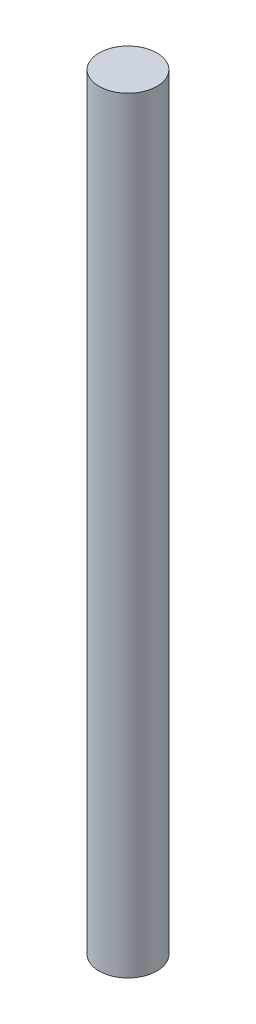
ISO-10303-21;
HEADER;
FILE_DESCRIPTION(('STEP AP214'),'2;1');
FILE_NAME('part.step','',(''),(''),'','','');
FILE_SCHEMA(('AUTOMOTIVE_DESIGN { 1 0 10303 214 1 1 1 1 }'));
ENDSEC;
DATA;
#1=APPLICATION_CONTEXT('core data for automotive mechanical design processes');
#2=APPLICATION_PROTOCOL_DEFINITION('international standard','automotive_design',2000,#1);
#3=PRODUCT_CONTEXT('',#1,'mechanical');
#4=PRODUCT('Part','Part','',(#3));
#5=PRODUCT_RELATED_PRODUCT_CATEGORY('part','',(#4));
#6=PRODUCT_DEFINITION_FORMATION('','',#4);
#7=PRODUCT_DEFINITION_CONTEXT('part definition',#1,'design');
#8=PRODUCT_DEFINITION('design','',#6,#7);
#9=PRODUCT_DEFINITION_SHAPE('','',#8);
#10=(LENGTH_UNIT() NAMED_UNIT(*) SI_UNIT(.MILLI.,.METRE.));
#11=(NAMED_UNIT(*) PLANE_ANGLE_UNIT() SI_UNIT($,.RADIAN.));
#12=(NAMED_UNIT(*) SI_UNIT($,.STERADIAN.) SOLID_ANGLE_UNIT());
#13=UNCERTAINTY_MEASURE_WITH_UNIT(LENGTH_MEASURE(1.E-05),#10,'distance_accuracy_value','');
#14=(GEOMETRIC_REPRESENTATION_CONTEXT(3) GLOBAL_UNCERTAINTY_ASSIGNED_CONTEXT((#13)) GLOBAL_UNIT_ASSIGNED_CONTEXT((#10,
#11,#12)) REPRESENTATION_CONTEXT('',''));
#15=CARTESIAN_POINT('',(0.,0.,0.));
#16=DIRECTION('',(0.,0.,1.));
#17=DIRECTION('',(1.,0.,0.));
#18=AXIS2_PLACEMENT_3D('',#15,#16,#17);
#19=CARTESIAN_POINT('',(0.,84.074,0.));
#20=DIRECTION('',(0.,-1.,0.));
#21=DIRECTION('',(0.,0.,-1.));
#22=AXIS2_PLACEMENT_3D('',#19,#20,#21);
#23=CYLINDRICAL_SURFACE('',#22,3.175);
#24=CARTESIAN_POINT('',(0.,84.074,0.));
#25=DIRECTION('',(0.,1.,0.));
#26=DIRECTION('',(0.,0.,1.));
#27=AXIS2_PLACEMENT_3D('',#24,#25,#26);
#28=CIRCLE('',#27,3.175);
#29=CARTESIAN_POINT('',(0.,84.074,3.175));
#30=VERTEX_POINT('',#29);
#31=EDGE_CURVE('E10',#30,#30,#28,.T.);
#32=ORIENTED_EDGE('',*,*,#31,.F.);
#33=EDGE_LOOP('',(#32));
#34=FACE_BOUND('',#33,.T.);
#35=CARTESIAN_POINT('',(0.,0.,0.));
#36=DIRECTION('',(0.,1.,0.));
#37=DIRECTION('',(0.,0.,1.));
#38=AXIS2_PLACEMENT_3D('',#35,#36,#37);
#39=CIRCLE('',#38,3.175);
#40=CARTESIAN_POINT('',(0.,0.,3.175));
#41=VERTEX_POINT('',#40);
#42=EDGE_CURVE('E40',#41,#41,#39,.T.);
#43=ORIENTED_EDGE('',*,*,#42,.T.);
#44=EDGE_LOOP('',(#43));
#45=FACE_BOUND('',#44,.T.);
#46=ADVANCED_FACE('F37',(#34,#45),#23,.T.);
#47=CARTESIAN_POINT('',(0.,84.074,0.));
#48=DIRECTION('',(0.,1.,0.));
#49=DIRECTION('',(0.,0.,1.));
#50=AXIS2_PLACEMENT_3D('',#47,#48,#49);
#51=PLANE('',#50);
#52=ORIENTED_EDGE('',*,*,#31,.T.);
#53=EDGE_LOOP('',(#52));
#54=FACE_BOUND('',#53,.T.);
#55=ADVANCED_FACE('F52',(#54),#51,.T.);
#56=CARTESIAN_POINT('',(0.,0.,0.));
#57=DIRECTION('',(0.,1.,0.));
#58=DIRECTION('',(0.,0.,1.));
#59=AXIS2_PLACEMENT_3D('',#56,#57,#58);
#60=PLANE('',#59);
#61=ORIENTED_EDGE('',*,*,#42,.F.);
#62=EDGE_LOOP('',(#61));
#63=FACE_BOUND('',#62,.T.);
#64=ADVANCED_FACE('F50',(#63),#60,.F.);
#65=CLOSED_SHELL('',(#46,#55,#64));
#66=MANIFOLD_SOLID_BREP('B2',#65);
#67=ADVANCED_BREP_SHAPE_REPRESENTATION('',(#18,#66),#14);
#68=SHAPE_DEFINITION_REPRESENTATION(#9,#67);
ENDSEC;
END-ISO-10303-21;
